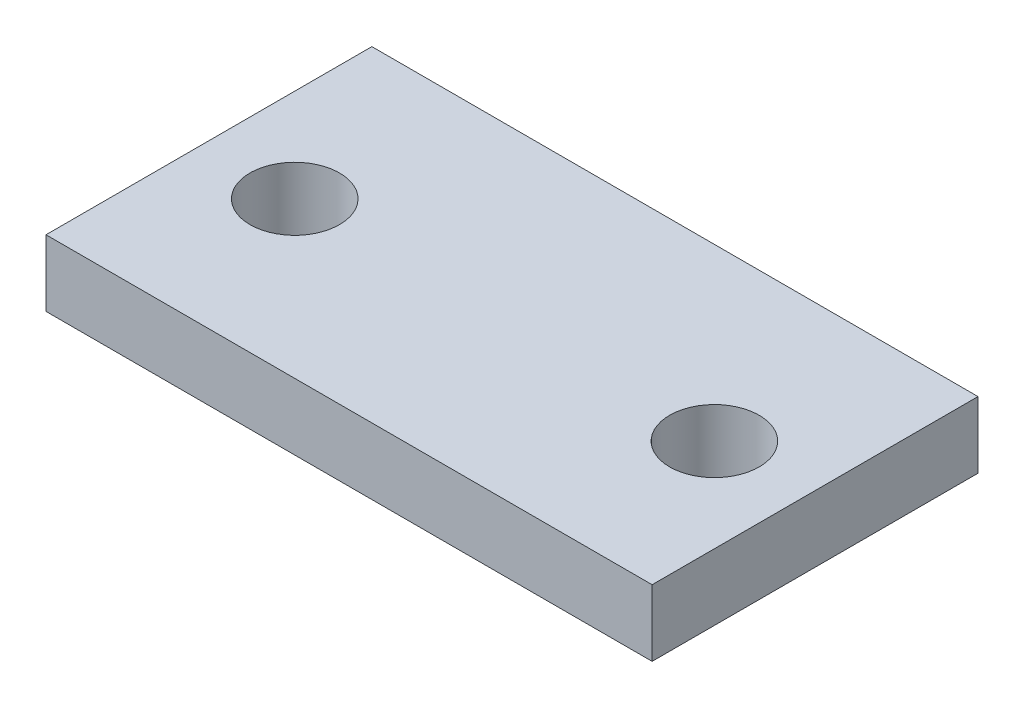
ISO-10303-21;
HEADER;
FILE_DESCRIPTION(('STEP AP214'),'2;1');
FILE_NAME('part.step','',(''),(''),'','','');
FILE_SCHEMA(('AUTOMOTIVE_DESIGN { 1 0 10303 214 1 1 1 1 }'));
ENDSEC;
DATA;
#1=APPLICATION_CONTEXT('core data for automotive mechanical design processes');
#2=APPLICATION_PROTOCOL_DEFINITION('international standard','automotive_design',2000,#1);
#3=PRODUCT_CONTEXT('',#1,'mechanical');
#4=PRODUCT('Part','Part','',(#3));
#5=PRODUCT_RELATED_PRODUCT_CATEGORY('part','',(#4));
#6=PRODUCT_DEFINITION_FORMATION('','',#4);
#7=PRODUCT_DEFINITION_CONTEXT('part definition',#1,'design');
#8=PRODUCT_DEFINITION('design','',#6,#7);
#9=PRODUCT_DEFINITION_SHAPE('','',#8);
#10=(LENGTH_UNIT() NAMED_UNIT(*) SI_UNIT(.MILLI.,.METRE.));
#11=(NAMED_UNIT(*) PLANE_ANGLE_UNIT() SI_UNIT($,.RADIAN.));
#12=(NAMED_UNIT(*) SI_UNIT($,.STERADIAN.) SOLID_ANGLE_UNIT());
#13=UNCERTAINTY_MEASURE_WITH_UNIT(LENGTH_MEASURE(1.E-05),#10,'distance_accuracy_value','');
#14=(GEOMETRIC_REPRESENTATION_CONTEXT(3) GLOBAL_UNCERTAINTY_ASSIGNED_CONTEXT((#13)) GLOBAL_UNIT_ASSIGNED_CONTEXT((#10,
#11,#12)) REPRESENTATION_CONTEXT('',''));
#15=CARTESIAN_POINT('',(0.,0.,0.));
#16=DIRECTION('',(0.,0.,1.));
#17=DIRECTION('',(1.,0.,0.));
#18=AXIS2_PLACEMENT_3D('',#15,#16,#17);
#19=CARTESIAN_POINT('',(-18.6460221612674,10.,-56.0607376822317));
#20=DIRECTION('',(-1.,0.,0.));
#21=DIRECTION('',(0.,0.,1.));
#22=AXIS2_PLACEMENT_3D('',#19,#20,#21);
#23=PLANE('',#22);
#24=DIRECTION('',(0.,0.,-1.));
#25=VECTOR('',#24,1.);
#26=CARTESIAN_POINT('',(-18.6460221612674,0.,-56.0607376822317));
#27=LINE('',#26,#25);
#28=CARTESIAN_POINT('',(-18.6460221612674,0.,-6.99225831047529));
#29=VERTEX_POINT('',#28);
#30=CARTESIAN_POINT('',(-18.6460221612674,0.,-56.0607376822317));
#31=VERTEX_POINT('',#30);
#32=EDGE_CURVE('E104',#29,#31,#27,.T.);
#33=ORIENTED_EDGE('',*,*,#32,.T.);
#34=DIRECTION('',(0.,-1.,0.));
#35=VECTOR('',#34,1.);
#36=CARTESIAN_POINT('',(-18.6460221612674,10.,-56.0607376822317));
#37=LINE('',#36,#35);
#38=CARTESIAN_POINT('',(-18.6460221612674,10.,-56.0607376822317));
#39=VERTEX_POINT('',#38);
#40=EDGE_CURVE('E11',#39,#31,#37,.T.);
#41=ORIENTED_EDGE('',*,*,#40,.F.);
#42=DIRECTION('',(0.,0.,-1.));
#43=VECTOR('',#42,1.);
#44=CARTESIAN_POINT('',(-18.6460221612674,10.,-56.0607376822317));
#45=LINE('',#44,#43);
#46=CARTESIAN_POINT('',(-18.6460221612674,10.,-6.99225831047529));
#47=VERTEX_POINT('',#46);
#48=EDGE_CURVE('E92',#47,#39,#45,.T.);
#49=ORIENTED_EDGE('',*,*,#48,.F.);
#50=DIRECTION('',(0.,-1.,0.));
#51=VECTOR('',#50,1.);
#52=CARTESIAN_POINT('',(-18.6460221612674,10.,-6.99225831047529));
#53=LINE('',#52,#51);
#54=EDGE_CURVE('E100',#47,#29,#53,.T.);
#55=ORIENTED_EDGE('',*,*,#54,.T.);
#56=EDGE_LOOP('',(#33,#41,#49,#55));
#57=FACE_BOUND('',#56,.T.);
#58=ADVANCED_FACE('F41',(#57),#23,.F.);
#59=CARTESIAN_POINT('',(-109.913393792734,10.,-56.0607376822317));
#60=DIRECTION('',(0.,0.,1.));
#61=DIRECTION('',(1.,0.,0.));
#62=AXIS2_PLACEMENT_3D('',#59,#60,#61);
#63=PLANE('',#62);
#64=DIRECTION('',(-1.,0.,0.));
#65=VECTOR('',#64,1.);
#66=CARTESIAN_POINT('',(-109.913393792734,0.,-56.0607376822317));
#67=LINE('',#66,#65);
#68=CARTESIAN_POINT('',(-109.913393792734,0.,-56.0607376822317));
#69=VERTEX_POINT('',#68);
#70=EDGE_CURVE('E96',#31,#69,#67,.T.);
#71=ORIENTED_EDGE('',*,*,#70,.T.);
#72=DIRECTION('',(0.,-1.,0.));
#73=VECTOR('',#72,1.);
#74=CARTESIAN_POINT('',(-109.913393792734,10.,-56.0607376822317));
#75=LINE('',#74,#73);
#76=CARTESIAN_POINT('',(-109.913393792734,10.,-56.0607376822317));
#77=VERTEX_POINT('',#76);
#78=EDGE_CURVE('E49',#77,#69,#75,.T.);
#79=ORIENTED_EDGE('',*,*,#78,.F.);
#80=DIRECTION('',(-1.,0.,0.));
#81=VECTOR('',#80,1.);
#82=CARTESIAN_POINT('',(-109.913393792734,10.,-56.0607376822317));
#83=LINE('',#82,#81);
#84=EDGE_CURVE('E87',#39,#77,#83,.T.);
#85=ORIENTED_EDGE('',*,*,#84,.F.);
#86=ORIENTED_EDGE('',*,*,#40,.T.);
#87=EDGE_LOOP('',(#71,#79,#85,#86));
#88=FACE_BOUND('',#87,.T.);
#89=ADVANCED_FACE('F95',(#88),#63,.F.);
#90=CARTESIAN_POINT('',(-109.913393792734,10.,-56.0607376822317));
#91=DIRECTION('',(1.,0.,0.));
#92=DIRECTION('',(0.,0.,-1.));
#93=AXIS2_PLACEMENT_3D('',#90,#91,#92);
#94=PLANE('',#93);
#95=DIRECTION('',(0.,0.,1.));
#96=VECTOR('',#95,1.);
#97=CARTESIAN_POINT('',(-109.913393792734,0.,-56.0607376822317));
#98=LINE('',#97,#96);
#99=CARTESIAN_POINT('',(-109.913393792734,0.,-6.99225831047529));
#100=VERTEX_POINT('',#99);
#101=EDGE_CURVE('E74',#69,#100,#98,.T.);
#102=ORIENTED_EDGE('',*,*,#101,.T.);
#103=DIRECTION('',(0.,-1.,0.));
#104=VECTOR('',#103,1.);
#105=CARTESIAN_POINT('',(-109.913393792734,10.,-6.99225831047529));
#106=LINE('',#105,#104);
#107=CARTESIAN_POINT('',(-109.913393792734,10.,-6.99225831047529));
#108=VERTEX_POINT('',#107);
#109=EDGE_CURVE('E97',#108,#100,#106,.T.);
#110=ORIENTED_EDGE('',*,*,#109,.F.);
#111=DIRECTION('',(0.,0.,1.));
#112=VECTOR('',#111,1.);
#113=CARTESIAN_POINT('',(-109.913393792734,10.,-56.0607376822317));
#114=LINE('',#113,#112);
#115=EDGE_CURVE('E90',#77,#108,#114,.T.);
#116=ORIENTED_EDGE('',*,*,#115,.F.);
#117=ORIENTED_EDGE('',*,*,#78,.T.);
#118=EDGE_LOOP('',(#102,#110,#116,#117));
#119=FACE_BOUND('',#118,.T.);
#120=ADVANCED_FACE('F98',(#119),#94,.F.);
#121=CARTESIAN_POINT('',(-109.913393792734,10.,-6.99225831047529));
#122=DIRECTION('',(0.,0.,-1.));
#123=DIRECTION('',(-1.,0.,0.));
#124=AXIS2_PLACEMENT_3D('',#121,#122,#123);
#125=PLANE('',#124);
#126=DIRECTION('',(1.,0.,0.));
#127=VECTOR('',#126,1.);
#128=CARTESIAN_POINT('',(-109.913393792734,0.,-6.99225831047529));
#129=LINE('',#128,#127);
#130=EDGE_CURVE('E80',#100,#29,#129,.T.);
#131=ORIENTED_EDGE('',*,*,#130,.T.);
#132=ORIENTED_EDGE('',*,*,#54,.F.);
#133=DIRECTION('',(1.,0.,0.));
#134=VECTOR('',#133,1.);
#135=CARTESIAN_POINT('',(-109.913393792734,10.,-6.99225831047529));
#136=LINE('',#135,#134);
#137=EDGE_CURVE('E57',#108,#47,#136,.T.);
#138=ORIENTED_EDGE('',*,*,#137,.F.);
#139=ORIENTED_EDGE('',*,*,#109,.T.);
#140=EDGE_LOOP('',(#131,#132,#138,#139));
#141=FACE_BOUND('',#140,.T.);
#142=ADVANCED_FACE('F112',(#141),#125,.F.);
#143=CARTESIAN_POINT('',(0.,10.,0.));
#144=DIRECTION('',(0.,1.,0.));
#145=DIRECTION('',(0.,0.,1.));
#146=AXIS2_PLACEMENT_3D('',#143,#144,#145);
#147=PLANE('',#146);
#148=CARTESIAN_POINT('',(-32.6841123779969,10.,-30.4084999982349));
#149=DIRECTION('',(0.,-1.,0.));
#150=DIRECTION('',(0.,0.,1.));
#151=AXIS2_PLACEMENT_3D('',#148,#149,#150);
#152=CIRCLE('',#151,6.74241878228048);
#153=CARTESIAN_POINT('',(-32.6841123779969,10.,-23.6660812159544));
#154=VERTEX_POINT('',#153);
#155=EDGE_CURVE('E124',#154,#154,#152,.T.);
#156=ORIENTED_EDGE('',*,*,#155,.T.);
#157=EDGE_LOOP('',(#156));
#158=FACE_BOUND('',#157,.T.);
#159=CARTESIAN_POINT('',(-95.8753035760048,10.,-30.4084999982349));
#160=DIRECTION('',(0.,1.,0.));
#161=DIRECTION('',(0.,0.,1.));
#162=AXIS2_PLACEMENT_3D('',#159,#160,#161);
#163=CIRCLE('',#162,6.74241878228048);
#164=CARTESIAN_POINT('',(-95.8753035760048,10.,-23.6660812159544));
#165=VERTEX_POINT('',#164);
#166=EDGE_CURVE('E118',#165,#165,#163,.T.);
#167=ORIENTED_EDGE('',*,*,#166,.F.);
#168=EDGE_LOOP('',(#167));
#169=FACE_BOUND('',#168,.T.);
#170=ORIENTED_EDGE('',*,*,#48,.T.);
#171=ORIENTED_EDGE('',*,*,#84,.T.);
#172=ORIENTED_EDGE('',*,*,#115,.T.);
#173=ORIENTED_EDGE('',*,*,#137,.T.);
#174=EDGE_LOOP('',(#170,#171,#172,#173));
#175=FACE_BOUND('',#174,.T.);
#176=ADVANCED_FACE('F88',(#158,#169,#175),#147,.T.);
#177=CARTESIAN_POINT('',(0.,0.,0.));
#178=DIRECTION('',(0.,1.,0.));
#179=DIRECTION('',(0.,0.,1.));
#180=AXIS2_PLACEMENT_3D('',#177,#178,#179);
#181=PLANE('',#180);
#182=CARTESIAN_POINT('',(-32.6841123779969,0.,-30.4084999982349));
#183=DIRECTION('',(0.,-1.,0.));
#184=DIRECTION('',(0.,0.,1.));
#185=AXIS2_PLACEMENT_3D('',#182,#183,#184);
#186=CIRCLE('',#185,6.74241878228048);
#187=CARTESIAN_POINT('',(-32.6841123779969,0.,-23.6660812159544));
#188=VERTEX_POINT('',#187);
#189=EDGE_CURVE('E121',#188,#188,#186,.T.);
#190=ORIENTED_EDGE('',*,*,#189,.F.);
#191=EDGE_LOOP('',(#190));
#192=FACE_BOUND('',#191,.T.);
#193=CARTESIAN_POINT('',(-95.8753035760048,0.,-30.4084999982349));
#194=DIRECTION('',(0.,1.,0.));
#195=DIRECTION('',(0.,0.,1.));
#196=AXIS2_PLACEMENT_3D('',#193,#194,#195);
#197=CIRCLE('',#196,6.74241878228048);
#198=CARTESIAN_POINT('',(-95.8753035760048,0.,-23.6660812159544));
#199=VERTEX_POINT('',#198);
#200=EDGE_CURVE('E107',#199,#199,#197,.T.);
#201=ORIENTED_EDGE('',*,*,#200,.T.);
#202=EDGE_LOOP('',(#201));
#203=FACE_BOUND('',#202,.T.);
#204=ORIENTED_EDGE('',*,*,#32,.F.);
#205=ORIENTED_EDGE('',*,*,#130,.F.);
#206=ORIENTED_EDGE('',*,*,#101,.F.);
#207=ORIENTED_EDGE('',*,*,#70,.F.);
#208=EDGE_LOOP('',(#204,#205,#206,#207));
#209=FACE_BOUND('',#208,.T.);
#210=ADVANCED_FACE('F115',(#192,#203,#209),#181,.F.);
#211=CARTESIAN_POINT('',(-95.8753035760048,0.,-30.4084999982349));
#212=DIRECTION('',(0.,1.,0.));
#213=DIRECTION('',(0.,0.,1.));
#214=AXIS2_PLACEMENT_3D('',#211,#212,#213);
#215=CYLINDRICAL_SURFACE('',#214,6.74241878228048);
#216=ORIENTED_EDGE('',*,*,#200,.F.);
#217=EDGE_LOOP('',(#216));
#218=FACE_BOUND('',#217,.T.);
#219=ORIENTED_EDGE('',*,*,#166,.T.);
#220=EDGE_LOOP('',(#219));
#221=FACE_BOUND('',#220,.T.);
#222=ADVANCED_FACE('F135',(#218,#221),#215,.F.);
#223=CARTESIAN_POINT('',(-32.6841123779969,0.,-30.4084999982349));
#224=DIRECTION('',(0.,1.,0.));
#225=DIRECTION('',(0.,0.,1.));
#226=AXIS2_PLACEMENT_3D('',#223,#224,#225);
#227=CYLINDRICAL_SURFACE('',#226,6.74241878228048);
#228=ORIENTED_EDGE('',*,*,#189,.T.);
#229=EDGE_LOOP('',(#228));
#230=FACE_BOUND('',#229,.T.);
#231=ORIENTED_EDGE('',*,*,#155,.F.);
#232=EDGE_LOOP('',(#231));
#233=FACE_BOUND('',#232,.T.);
#234=ADVANCED_FACE('F130',(#230,#233),#227,.F.);
#235=CLOSED_SHELL('',(#58,#89,#120,#142,#176,#210,#222,#234));
#236=MANIFOLD_SOLID_BREP('B2',#235);
#237=ADVANCED_BREP_SHAPE_REPRESENTATION('',(#18,#236),#14);
#238=SHAPE_DEFINITION_REPRESENTATION(#9,#237);
ENDSEC;
END-ISO-10303-21;
